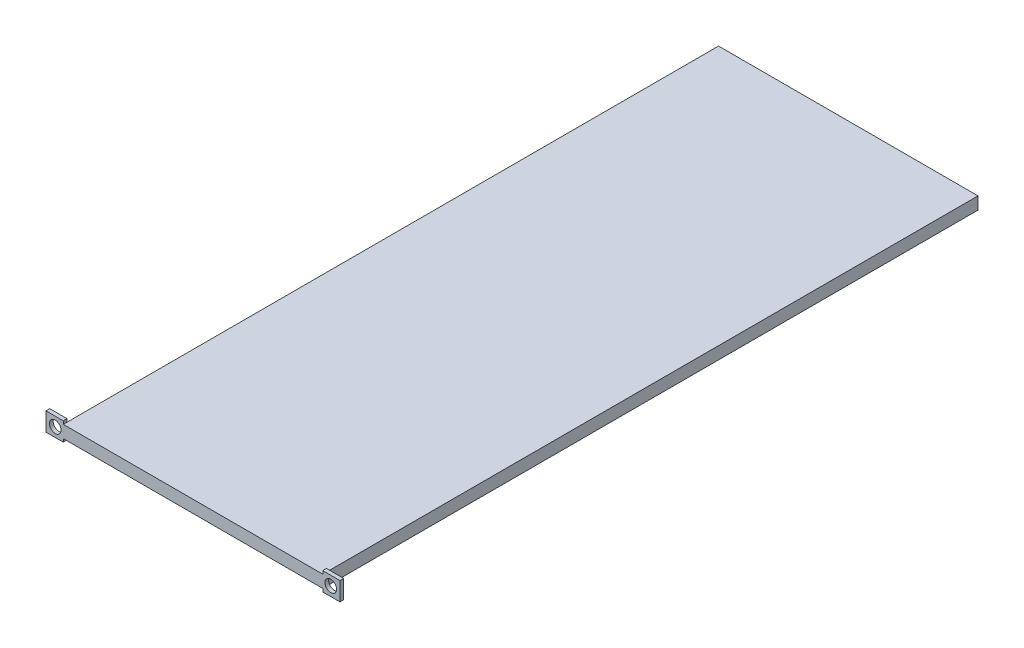
ISO-10303-21;
HEADER;
FILE_DESCRIPTION(('STEP AP214'),'2;1');
FILE_NAME('part.step','',(''),(''),'','','');
FILE_SCHEMA(('AUTOMOTIVE_DESIGN { 1 0 10303 214 1 1 1 1 }'));
ENDSEC;
DATA;
#1=APPLICATION_CONTEXT('core data for automotive mechanical design processes');
#2=APPLICATION_PROTOCOL_DEFINITION('international standard','automotive_design',2000,#1);
#3=PRODUCT_CONTEXT('',#1,'mechanical');
#4=PRODUCT('Part','Part','',(#3));
#5=PRODUCT_RELATED_PRODUCT_CATEGORY('part','',(#4));
#6=PRODUCT_DEFINITION_FORMATION('','',#4);
#7=PRODUCT_DEFINITION_CONTEXT('part definition',#1,'design');
#8=PRODUCT_DEFINITION('design','',#6,#7);
#9=PRODUCT_DEFINITION_SHAPE('','',#8);
#10=(LENGTH_UNIT() NAMED_UNIT(*) SI_UNIT(.MILLI.,.METRE.));
#11=(NAMED_UNIT(*) PLANE_ANGLE_UNIT() SI_UNIT($,.RADIAN.));
#12=(NAMED_UNIT(*) SI_UNIT($,.STERADIAN.) SOLID_ANGLE_UNIT());
#13=UNCERTAINTY_MEASURE_WITH_UNIT(LENGTH_MEASURE(1.E-05),#10,'distance_accuracy_value','');
#14=(GEOMETRIC_REPRESENTATION_CONTEXT(3) GLOBAL_UNCERTAINTY_ASSIGNED_CONTEXT((#13)) GLOBAL_UNIT_ASSIGNED_CONTEXT((#10,
#11,#12)) REPRESENTATION_CONTEXT('',''));
#15=CARTESIAN_POINT('',(0.,0.,0.));
#16=DIRECTION('',(0.,0.,1.));
#17=DIRECTION('',(1.,0.,0.));
#18=AXIS2_PLACEMENT_3D('',#15,#16,#17);
#19=CARTESIAN_POINT('',(210.28,0.,531.));
#20=DIRECTION('',(-1.,0.,0.));
#21=DIRECTION('',(0.,0.,1.));
#22=AXIS2_PLACEMENT_3D('',#19,#20,#21);
#23=PLANE('',#22);
#24=DIRECTION('',(0.,1.,0.));
#25=VECTOR('',#24,1.);
#26=CARTESIAN_POINT('',(210.28,12.5,528.));
#27=LINE('',#26,#25);
#28=CARTESIAN_POINT('',(210.28,0.,528.));
#29=VERTEX_POINT('',#28);
#30=CARTESIAN_POINT('',(210.28,10.,528.));
#31=VERTEX_POINT('',#30);
#32=EDGE_CURVE('E11',#29,#31,#27,.T.);
#33=ORIENTED_EDGE('',*,*,#32,.F.);
#34=DIRECTION('',(0.,0.,-1.));
#35=VECTOR('',#34,1.);
#36=CARTESIAN_POINT('',(210.28,0.,531.));
#37=LINE('',#36,#35);
#38=CARTESIAN_POINT('',(210.28,0.,0.));
#39=VERTEX_POINT('',#38);
#40=EDGE_CURVE('E228',#29,#39,#37,.T.);
#41=ORIENTED_EDGE('',*,*,#40,.T.);
#42=DIRECTION('',(0.,1.,0.));
#43=VECTOR('',#42,1.);
#44=CARTESIAN_POINT('',(210.28,0.,0.));
#45=LINE('',#44,#43);
#46=CARTESIAN_POINT('',(210.28,10.,0.));
#47=VERTEX_POINT('',#46);
#48=EDGE_CURVE('E218',#39,#47,#45,.T.);
#49=ORIENTED_EDGE('',*,*,#48,.T.);
#50=DIRECTION('',(0.,0.,-1.));
#51=VECTOR('',#50,1.);
#52=CARTESIAN_POINT('',(210.28,10.,531.));
#53=LINE('',#52,#51);
#54=EDGE_CURVE('E226',#31,#47,#53,.T.);
#55=ORIENTED_EDGE('',*,*,#54,.F.);
#56=EDGE_LOOP('',(#33,#41,#49,#55));
#57=FACE_BOUND('',#56,.T.);
#58=ADVANCED_FACE('F39',(#57),#23,.F.);
#59=CARTESIAN_POINT('',(0.,0.,531.));
#60=DIRECTION('',(1.,0.,0.));
#61=DIRECTION('',(0.,0.,-1.));
#62=AXIS2_PLACEMENT_3D('',#59,#60,#61);
#63=PLANE('',#62);
#64=DIRECTION('',(0.,-1.,0.));
#65=VECTOR('',#64,1.);
#66=CARTESIAN_POINT('',(0.,12.5,528.));
#67=LINE('',#66,#65);
#68=CARTESIAN_POINT('',(0.,10.,528.));
#69=VERTEX_POINT('',#68);
#70=CARTESIAN_POINT('',(0.,0.,528.));
#71=VERTEX_POINT('',#70);
#72=EDGE_CURVE('E48',#69,#71,#67,.T.);
#73=ORIENTED_EDGE('',*,*,#72,.F.);
#74=DIRECTION('',(0.,0.,-1.));
#75=VECTOR('',#74,1.);
#76=CARTESIAN_POINT('',(0.,10.,531.));
#77=LINE('',#76,#75);
#78=CARTESIAN_POINT('',(0.,10.,0.));
#79=VERTEX_POINT('',#78);
#80=EDGE_CURVE('E212',#69,#79,#77,.T.);
#81=ORIENTED_EDGE('',*,*,#80,.T.);
#82=DIRECTION('',(0.,-1.,0.));
#83=VECTOR('',#82,1.);
#84=CARTESIAN_POINT('',(0.,0.,0.));
#85=LINE('',#84,#83);
#86=CARTESIAN_POINT('',(0.,0.,0.));
#87=VERTEX_POINT('',#86);
#88=EDGE_CURVE('E206',#79,#87,#85,.T.);
#89=ORIENTED_EDGE('',*,*,#88,.T.);
#90=DIRECTION('',(0.,0.,-1.));
#91=VECTOR('',#90,1.);
#92=CARTESIAN_POINT('',(0.,0.,531.));
#93=LINE('',#92,#91);
#94=EDGE_CURVE('E231',#71,#87,#93,.T.);
#95=ORIENTED_EDGE('',*,*,#94,.F.);
#96=EDGE_LOOP('',(#73,#81,#89,#95));
#97=FACE_BOUND('',#96,.T.);
#98=ADVANCED_FACE('F41',(#97),#63,.F.);
#99=CARTESIAN_POINT('',(0.,0.,531.));
#100=DIRECTION('',(0.,1.,0.));
#101=DIRECTION('',(0.,0.,1.));
#102=AXIS2_PLACEMENT_3D('',#99,#100,#101);
#103=PLANE('',#102);
#104=DIRECTION('',(1.,0.,0.));
#105=VECTOR('',#104,1.);
#106=CARTESIAN_POINT('',(0.,0.,0.));
#107=LINE('',#106,#105);
#108=EDGE_CURVE('E215',#87,#39,#107,.T.);
#109=ORIENTED_EDGE('',*,*,#108,.T.);
#110=ORIENTED_EDGE('',*,*,#40,.F.);
#111=CARTESIAN_POINT('',(210.28,0.,531.));
#112=VERTEX_POINT('',#111);
#113=EDGE_CURVE('E229',#112,#29,#37,.T.);
#114=ORIENTED_EDGE('',*,*,#113,.F.);
#115=DIRECTION('',(1.,0.,0.));
#116=VECTOR('',#115,1.);
#117=CARTESIAN_POINT('',(0.,0.,531.));
#118=LINE('',#117,#116);
#119=CARTESIAN_POINT('',(0.,0.,531.));
#120=VERTEX_POINT('',#119);
#121=EDGE_CURVE('E207',#120,#112,#118,.T.);
#122=ORIENTED_EDGE('',*,*,#121,.F.);
#123=EDGE_CURVE('E43',#120,#71,#93,.T.);
#124=ORIENTED_EDGE('',*,*,#123,.T.);
#125=ORIENTED_EDGE('',*,*,#94,.T.);
#126=EDGE_LOOP('',(#109,#110,#114,#122,#124,#125));
#127=FACE_BOUND('',#126,.T.);
#128=ADVANCED_FACE('F240',(#127),#103,.F.);
#129=CARTESIAN_POINT('',(0.,10.,531.));
#130=DIRECTION('',(0.,-1.,0.));
#131=DIRECTION('',(0.,0.,-1.));
#132=AXIS2_PLACEMENT_3D('',#129,#130,#131);
#133=PLANE('',#132);
#134=DIRECTION('',(-1.,0.,0.));
#135=VECTOR('',#134,1.);
#136=CARTESIAN_POINT('',(0.,10.,0.));
#137=LINE('',#136,#135);
#138=EDGE_CURVE('E210',#47,#79,#137,.T.);
#139=ORIENTED_EDGE('',*,*,#138,.T.);
#140=ORIENTED_EDGE('',*,*,#80,.F.);
#141=CARTESIAN_POINT('',(0.,10.,531.));
#142=VERTEX_POINT('',#141);
#143=EDGE_CURVE('E223',#142,#69,#77,.T.);
#144=ORIENTED_EDGE('',*,*,#143,.F.);
#145=DIRECTION('',(-1.,0.,0.));
#146=VECTOR('',#145,1.);
#147=CARTESIAN_POINT('',(0.,10.,531.));
#148=LINE('',#147,#146);
#149=CARTESIAN_POINT('',(210.28,10.,531.));
#150=VERTEX_POINT('',#149);
#151=EDGE_CURVE('E209',#150,#142,#148,.T.);
#152=ORIENTED_EDGE('',*,*,#151,.F.);
#153=EDGE_CURVE('E227',#150,#31,#53,.T.);
#154=ORIENTED_EDGE('',*,*,#153,.T.);
#155=ORIENTED_EDGE('',*,*,#54,.T.);
#156=EDGE_LOOP('',(#139,#140,#144,#152,#154,#155));
#157=FACE_BOUND('',#156,.T.);
#158=ADVANCED_FACE('F245',(#157),#133,.F.);
#159=CARTESIAN_POINT('',(0.,0.,531.));
#160=DIRECTION('',(0.,0.,-1.));
#161=DIRECTION('',(-1.,0.,0.));
#162=AXIS2_PLACEMENT_3D('',#159,#160,#161);
#163=PLANE('',#162);
#164=CARTESIAN_POINT('',(-6.5,5.,531.));
#165=DIRECTION('',(0.,0.,-1.));
#166=DIRECTION('',(-1.,0.,0.));
#167=AXIS2_PLACEMENT_3D('',#164,#165,#166);
#168=CIRCLE('',#167,4.7);
#169=CARTESIAN_POINT('',(-11.2,5.,531.));
#170=VERTEX_POINT('',#169);
#171=EDGE_CURVE('E269',#170,#170,#168,.T.);
#172=ORIENTED_EDGE('',*,*,#171,.T.);
#173=EDGE_LOOP('',(#172));
#174=FACE_BOUND('',#173,.T.);
#175=CARTESIAN_POINT('',(216.78,5.,531.));
#176=DIRECTION('',(0.,0.,-1.));
#177=DIRECTION('',(-1.,0.,0.));
#178=AXIS2_PLACEMENT_3D('',#175,#176,#177);
#179=CIRCLE('',#178,4.69999999999998);
#180=CARTESIAN_POINT('',(212.08,5.,531.));
#181=VERTEX_POINT('',#180);
#182=EDGE_CURVE('E271',#181,#181,#179,.T.);
#183=ORIENTED_EDGE('',*,*,#182,.T.);
#184=EDGE_LOOP('',(#183));
#185=FACE_BOUND('',#184,.T.);
#186=ORIENTED_EDGE('',*,*,#151,.T.);
#187=DIRECTION('',(0.,1.,0.));
#188=VECTOR('',#187,1.);
#189=CARTESIAN_POINT('',(0.,12.5,531.));
#190=LINE('',#189,#188);
#191=CARTESIAN_POINT('',(0.,12.5,531.));
#192=VERTEX_POINT('',#191);
#193=EDGE_CURVE('E168',#142,#192,#190,.T.);
#194=ORIENTED_EDGE('',*,*,#193,.T.);
#195=DIRECTION('',(1.,0.,0.));
#196=VECTOR('',#195,1.);
#197=CARTESIAN_POINT('',(-14.,12.5,531.));
#198=LINE('',#197,#196);
#199=CARTESIAN_POINT('',(-14.,12.5,531.));
#200=VERTEX_POINT('',#199);
#201=EDGE_CURVE('E203',#200,#192,#198,.T.);
#202=ORIENTED_EDGE('',*,*,#201,.F.);
#203=DIRECTION('',(0.,1.,0.));
#204=VECTOR('',#203,1.);
#205=CARTESIAN_POINT('',(-14.,12.5,531.));
#206=LINE('',#205,#204);
#207=CARTESIAN_POINT('',(-14.,-2.5,531.));
#208=VERTEX_POINT('',#207);
#209=EDGE_CURVE('E176',#208,#200,#206,.T.);
#210=ORIENTED_EDGE('',*,*,#209,.F.);
#211=DIRECTION('',(1.,0.,0.));
#212=VECTOR('',#211,1.);
#213=CARTESIAN_POINT('',(-14.,-2.5,531.));
#214=LINE('',#213,#212);
#215=CARTESIAN_POINT('',(0.,-2.5,531.));
#216=VERTEX_POINT('',#215);
#217=EDGE_CURVE('E185',#208,#216,#214,.T.);
#218=ORIENTED_EDGE('',*,*,#217,.T.);
#219=EDGE_CURVE('E170',#216,#120,#190,.T.);
#220=ORIENTED_EDGE('',*,*,#219,.T.);
#221=ORIENTED_EDGE('',*,*,#121,.T.);
#222=DIRECTION('',(0.,-1.,0.));
#223=VECTOR('',#222,1.);
#224=CARTESIAN_POINT('',(210.28,12.5,531.));
#225=LINE('',#224,#223);
#226=CARTESIAN_POINT('',(210.28,-2.5,531.));
#227=VERTEX_POINT('',#226);
#228=EDGE_CURVE('E166',#112,#227,#225,.T.);
#229=ORIENTED_EDGE('',*,*,#228,.T.);
#230=DIRECTION('',(-1.,0.,0.));
#231=VECTOR('',#230,1.);
#232=CARTESIAN_POINT('',(224.28,-2.5,531.));
#233=LINE('',#232,#231);
#234=CARTESIAN_POINT('',(224.28,-2.5,531.));
#235=VERTEX_POINT('',#234);
#236=EDGE_CURVE('E147',#235,#227,#233,.T.);
#237=ORIENTED_EDGE('',*,*,#236,.F.);
#238=DIRECTION('',(0.,-1.,0.));
#239=VECTOR('',#238,1.);
#240=CARTESIAN_POINT('',(224.28,12.5,531.));
#241=LINE('',#240,#239);
#242=CARTESIAN_POINT('',(224.28,12.5,531.));
#243=VERTEX_POINT('',#242);
#244=EDGE_CURVE('E153',#243,#235,#241,.T.);
#245=ORIENTED_EDGE('',*,*,#244,.F.);
#246=DIRECTION('',(-1.,0.,0.));
#247=VECTOR('',#246,1.);
#248=CARTESIAN_POINT('',(224.28,12.5,531.));
#249=LINE('',#248,#247);
#250=CARTESIAN_POINT('',(210.28,12.5,531.));
#251=VERTEX_POINT('',#250);
#252=EDGE_CURVE('E263',#243,#251,#249,.T.);
#253=ORIENTED_EDGE('',*,*,#252,.T.);
#254=EDGE_CURVE('E268',#251,#150,#225,.T.);
#255=ORIENTED_EDGE('',*,*,#254,.T.);
#256=EDGE_LOOP('',(#186,#194,#202,#210,#218,#220,#221,#229,#237,#245,#253,#255));
#257=FACE_BOUND('',#256,.T.);
#258=ADVANCED_FACE('F164',(#174,#185,#257),#163,.F.);
#259=CARTESIAN_POINT('',(0.,0.,0.));
#260=DIRECTION('',(0.,0.,-1.));
#261=DIRECTION('',(-1.,0.,0.));
#262=AXIS2_PLACEMENT_3D('',#259,#260,#261);
#263=PLANE('',#262);
#264=ORIENTED_EDGE('',*,*,#88,.F.);
#265=ORIENTED_EDGE('',*,*,#138,.F.);
#266=ORIENTED_EDGE('',*,*,#48,.F.);
#267=ORIENTED_EDGE('',*,*,#108,.F.);
#268=EDGE_LOOP('',(#264,#265,#266,#267));
#269=FACE_BOUND('',#268,.T.);
#270=ADVANCED_FACE('F243',(#269),#263,.T.);
#271=CARTESIAN_POINT('',(0.,0.,0.));
#272=DIRECTION('',(1.,0.,0.));
#273=DIRECTION('',(0.,0.,-1.));
#274=AXIS2_PLACEMENT_3D('',#271,#272,#273);
#275=PLANE('',#274);
#276=ORIENTED_EDGE('',*,*,#123,.F.);
#277=ORIENTED_EDGE('',*,*,#219,.F.);
#278=DIRECTION('',(0.,0.,1.));
#279=VECTOR('',#278,1.);
#280=CARTESIAN_POINT('',(0.,-2.5,531.));
#281=LINE('',#280,#279);
#282=CARTESIAN_POINT('',(0.,-2.5,528.));
#283=VERTEX_POINT('',#282);
#284=EDGE_CURVE('E180',#283,#216,#281,.T.);
#285=ORIENTED_EDGE('',*,*,#284,.F.);
#286=EDGE_CURVE('E190',#71,#283,#67,.T.);
#287=ORIENTED_EDGE('',*,*,#286,.F.);
#288=EDGE_LOOP('',(#276,#277,#285,#287));
#289=FACE_BOUND('',#288,.T.);
#290=ADVANCED_FACE('F314',(#289),#275,.T.);
#291=CARTESIAN_POINT('',(-14.,12.5,531.));
#292=DIRECTION('',(0.,-1.,0.));
#293=DIRECTION('',(0.,0.,-1.));
#294=AXIS2_PLACEMENT_3D('',#291,#292,#293);
#295=PLANE('',#294);
#296=DIRECTION('',(0.,0.,-1.));
#297=VECTOR('',#296,1.);
#298=CARTESIAN_POINT('',(0.,12.5,531.));
#299=LINE('',#298,#297);
#300=CARTESIAN_POINT('',(0.,12.5,528.));
#301=VERTEX_POINT('',#300);
#302=EDGE_CURVE('E188',#192,#301,#299,.T.);
#303=ORIENTED_EDGE('',*,*,#302,.T.);
#304=DIRECTION('',(1.,0.,0.));
#305=VECTOR('',#304,1.);
#306=CARTESIAN_POINT('',(-14.,12.5,528.));
#307=LINE('',#306,#305);
#308=CARTESIAN_POINT('',(-14.,12.5,528.));
#309=VERTEX_POINT('',#308);
#310=EDGE_CURVE('E200',#309,#301,#307,.T.);
#311=ORIENTED_EDGE('',*,*,#310,.F.);
#312=DIRECTION('',(0.,0.,-1.));
#313=VECTOR('',#312,1.);
#314=CARTESIAN_POINT('',(-14.,12.5,531.));
#315=LINE('',#314,#313);
#316=EDGE_CURVE('E179',#200,#309,#315,.T.);
#317=ORIENTED_EDGE('',*,*,#316,.F.);
#318=ORIENTED_EDGE('',*,*,#201,.T.);
#319=EDGE_LOOP('',(#303,#311,#317,#318));
#320=FACE_BOUND('',#319,.T.);
#321=ADVANCED_FACE('F292',(#320),#295,.F.);
#322=CARTESIAN_POINT('',(-14.,12.5,528.));
#323=DIRECTION('',(0.,0.,1.));
#324=DIRECTION('',(1.,0.,0.));
#325=AXIS2_PLACEMENT_3D('',#322,#323,#324);
#326=PLANE('',#325);
#327=CARTESIAN_POINT('',(-6.5,5.,528.));
#328=DIRECTION('',(0.,0.,-1.));
#329=DIRECTION('',(-1.,0.,0.));
#330=AXIS2_PLACEMENT_3D('',#327,#328,#329);
#331=CIRCLE('',#330,4.7);
#332=CARTESIAN_POINT('',(-11.2,5.,528.));
#333=VERTEX_POINT('',#332);
#334=EDGE_CURVE('E276',#333,#333,#331,.T.);
#335=ORIENTED_EDGE('',*,*,#334,.F.);
#336=EDGE_LOOP('',(#335));
#337=FACE_BOUND('',#336,.T.);
#338=EDGE_CURVE('E191',#301,#69,#67,.T.);
#339=ORIENTED_EDGE('',*,*,#338,.T.);
#340=ORIENTED_EDGE('',*,*,#72,.T.);
#341=ORIENTED_EDGE('',*,*,#286,.T.);
#342=DIRECTION('',(1.,0.,0.));
#343=VECTOR('',#342,1.);
#344=CARTESIAN_POINT('',(-14.,-2.5,528.));
#345=LINE('',#344,#343);
#346=CARTESIAN_POINT('',(-14.,-2.5,528.));
#347=VERTEX_POINT('',#346);
#348=EDGE_CURVE('E197',#347,#283,#345,.T.);
#349=ORIENTED_EDGE('',*,*,#348,.F.);
#350=DIRECTION('',(0.,-1.,0.));
#351=VECTOR('',#350,1.);
#352=CARTESIAN_POINT('',(-14.,12.5,528.));
#353=LINE('',#352,#351);
#354=EDGE_CURVE('E182',#309,#347,#353,.T.);
#355=ORIENTED_EDGE('',*,*,#354,.F.);
#356=ORIENTED_EDGE('',*,*,#310,.T.);
#357=EDGE_LOOP('',(#339,#340,#341,#349,#355,#356));
#358=FACE_BOUND('',#357,.T.);
#359=ADVANCED_FACE('F288',(#337,#358),#326,.F.);
#360=CARTESIAN_POINT('',(-14.,-2.5,531.));
#361=DIRECTION('',(0.,1.,0.));
#362=DIRECTION('',(0.,0.,1.));
#363=AXIS2_PLACEMENT_3D('',#360,#361,#362);
#364=PLANE('',#363);
#365=ORIENTED_EDGE('',*,*,#284,.T.);
#366=ORIENTED_EDGE('',*,*,#217,.F.);
#367=DIRECTION('',(0.,0.,1.));
#368=VECTOR('',#367,1.);
#369=CARTESIAN_POINT('',(-14.,-2.5,531.));
#370=LINE('',#369,#368);
#371=EDGE_CURVE('E184',#347,#208,#370,.T.);
#372=ORIENTED_EDGE('',*,*,#371,.F.);
#373=ORIENTED_EDGE('',*,*,#348,.T.);
#374=EDGE_LOOP('',(#365,#366,#372,#373));
#375=FACE_BOUND('',#374,.T.);
#376=ADVANCED_FACE('F291',(#375),#364,.F.);
#377=CARTESIAN_POINT('',(-14.,0.,0.));
#378=DIRECTION('',(1.,0.,0.));
#379=DIRECTION('',(0.,0.,-1.));
#380=AXIS2_PLACEMENT_3D('',#377,#378,#379);
#381=PLANE('',#380);
#382=ORIENTED_EDGE('',*,*,#209,.T.);
#383=ORIENTED_EDGE('',*,*,#316,.T.);
#384=ORIENTED_EDGE('',*,*,#354,.T.);
#385=ORIENTED_EDGE('',*,*,#371,.T.);
#386=EDGE_LOOP('',(#382,#383,#384,#385));
#387=FACE_BOUND('',#386,.T.);
#388=ADVANCED_FACE('F305',(#387),#381,.F.);
#389=ORIENTED_EDGE('',*,*,#193,.F.);
#390=ORIENTED_EDGE('',*,*,#143,.T.);
#391=ORIENTED_EDGE('',*,*,#338,.F.);
#392=ORIENTED_EDGE('',*,*,#302,.F.);
#393=EDGE_LOOP('',(#389,#390,#391,#392));
#394=FACE_BOUND('',#393,.T.);
#395=ADVANCED_FACE('F300',(#394),#275,.T.);
#396=CARTESIAN_POINT('',(210.28,0.,0.));
#397=DIRECTION('',(1.,0.,0.));
#398=DIRECTION('',(0.,0.,-1.));
#399=AXIS2_PLACEMENT_3D('',#396,#397,#398);
#400=PLANE('',#399);
#401=ORIENTED_EDGE('',*,*,#228,.F.);
#402=ORIENTED_EDGE('',*,*,#113,.T.);
#403=CARTESIAN_POINT('',(210.28,-2.5,528.));
#404=VERTEX_POINT('',#403);
#405=EDGE_CURVE('E50',#404,#29,#27,.T.);
#406=ORIENTED_EDGE('',*,*,#405,.F.);
#407=DIRECTION('',(0.,0.,-1.));
#408=VECTOR('',#407,1.);
#409=CARTESIAN_POINT('',(210.28,-2.5,531.));
#410=LINE('',#409,#408);
#411=EDGE_CURVE('E257',#227,#404,#410,.T.);
#412=ORIENTED_EDGE('',*,*,#411,.F.);
#413=EDGE_LOOP('',(#401,#402,#406,#412));
#414=FACE_BOUND('',#413,.T.);
#415=ADVANCED_FACE('F337',(#414),#400,.F.);
#416=CARTESIAN_POINT('',(224.28,-2.5,531.));
#417=DIRECTION('',(0.,1.,0.));
#418=DIRECTION('',(0.,0.,1.));
#419=AXIS2_PLACEMENT_3D('',#416,#417,#418);
#420=PLANE('',#419);
#421=ORIENTED_EDGE('',*,*,#411,.T.);
#422=DIRECTION('',(-1.,0.,0.));
#423=VECTOR('',#422,1.);
#424=CARTESIAN_POINT('',(224.28,-2.5,528.));
#425=LINE('',#424,#423);
#426=CARTESIAN_POINT('',(224.28,-2.5,528.));
#427=VERTEX_POINT('',#426);
#428=EDGE_CURVE('E149',#427,#404,#425,.T.);
#429=ORIENTED_EDGE('',*,*,#428,.F.);
#430=DIRECTION('',(0.,0.,-1.));
#431=VECTOR('',#430,1.);
#432=CARTESIAN_POINT('',(224.28,-2.5,531.));
#433=LINE('',#432,#431);
#434=EDGE_CURVE('E143',#235,#427,#433,.T.);
#435=ORIENTED_EDGE('',*,*,#434,.F.);
#436=ORIENTED_EDGE('',*,*,#236,.T.);
#437=EDGE_LOOP('',(#421,#429,#435,#436));
#438=FACE_BOUND('',#437,.T.);
#439=ADVANCED_FACE('F145',(#438),#420,.F.);
#440=CARTESIAN_POINT('',(224.28,12.5,528.));
#441=DIRECTION('',(0.,0.,1.));
#442=DIRECTION('',(1.,0.,0.));
#443=AXIS2_PLACEMENT_3D('',#440,#441,#442);
#444=PLANE('',#443);
#445=CARTESIAN_POINT('',(216.78,5.,528.));
#446=DIRECTION('',(0.,0.,-1.));
#447=DIRECTION('',(1.,0.,0.));
#448=AXIS2_PLACEMENT_3D('',#445,#446,#447);
#449=CIRCLE('',#448,4.69999999999998);
#450=CARTESIAN_POINT('',(221.48,5.,528.));
#451=VERTEX_POINT('',#450);
#452=EDGE_CURVE('E279',#451,#451,#449,.T.);
#453=ORIENTED_EDGE('',*,*,#452,.F.);
#454=EDGE_LOOP('',(#453));
#455=FACE_BOUND('',#454,.T.);
#456=ORIENTED_EDGE('',*,*,#405,.T.);
#457=ORIENTED_EDGE('',*,*,#32,.T.);
#458=CARTESIAN_POINT('',(210.28,12.5,528.));
#459=VERTEX_POINT('',#458);
#460=EDGE_CURVE('E51',#31,#459,#27,.T.);
#461=ORIENTED_EDGE('',*,*,#460,.T.);
#462=DIRECTION('',(-1.,0.,0.));
#463=VECTOR('',#462,1.);
#464=CARTESIAN_POINT('',(224.28,12.5,528.));
#465=LINE('',#464,#463);
#466=CARTESIAN_POINT('',(224.28,12.5,528.));
#467=VERTEX_POINT('',#466);
#468=EDGE_CURVE('E172',#467,#459,#465,.T.);
#469=ORIENTED_EDGE('',*,*,#468,.F.);
#470=DIRECTION('',(0.,1.,0.));
#471=VECTOR('',#470,1.);
#472=CARTESIAN_POINT('',(224.28,12.5,528.));
#473=LINE('',#472,#471);
#474=EDGE_CURVE('E152',#427,#467,#473,.T.);
#475=ORIENTED_EDGE('',*,*,#474,.F.);
#476=ORIENTED_EDGE('',*,*,#428,.T.);
#477=EDGE_LOOP('',(#456,#457,#461,#469,#475,#476));
#478=FACE_BOUND('',#477,.T.);
#479=ADVANCED_FACE('F258',(#455,#478),#444,.F.);
#480=CARTESIAN_POINT('',(224.28,12.5,531.));
#481=DIRECTION('',(0.,-1.,0.));
#482=DIRECTION('',(0.,0.,-1.));
#483=AXIS2_PLACEMENT_3D('',#480,#481,#482);
#484=PLANE('',#483);
#485=DIRECTION('',(0.,0.,1.));
#486=VECTOR('',#485,1.);
#487=CARTESIAN_POINT('',(210.28,12.5,531.));
#488=LINE('',#487,#486);
#489=EDGE_CURVE('E162',#459,#251,#488,.T.);
#490=ORIENTED_EDGE('',*,*,#489,.T.);
#491=ORIENTED_EDGE('',*,*,#252,.F.);
#492=DIRECTION('',(0.,0.,1.));
#493=VECTOR('',#492,1.);
#494=CARTESIAN_POINT('',(224.28,12.5,531.));
#495=LINE('',#494,#493);
#496=EDGE_CURVE('E158',#467,#243,#495,.T.);
#497=ORIENTED_EDGE('',*,*,#496,.F.);
#498=ORIENTED_EDGE('',*,*,#468,.T.);
#499=EDGE_LOOP('',(#490,#491,#497,#498));
#500=FACE_BOUND('',#499,.T.);
#501=ADVANCED_FACE('F265',(#500),#484,.F.);
#502=CARTESIAN_POINT('',(224.28,0.,0.));
#503=DIRECTION('',(1.,0.,0.));
#504=DIRECTION('',(0.,0.,-1.));
#505=AXIS2_PLACEMENT_3D('',#502,#503,#504);
#506=PLANE('',#505);
#507=ORIENTED_EDGE('',*,*,#244,.T.);
#508=ORIENTED_EDGE('',*,*,#434,.T.);
#509=ORIENTED_EDGE('',*,*,#474,.T.);
#510=ORIENTED_EDGE('',*,*,#496,.T.);
#511=EDGE_LOOP('',(#507,#508,#509,#510));
#512=FACE_BOUND('',#511,.T.);
#513=ADVANCED_FACE('F156',(#512),#506,.T.);
#514=ORIENTED_EDGE('',*,*,#153,.F.);
#515=ORIENTED_EDGE('',*,*,#254,.F.);
#516=ORIENTED_EDGE('',*,*,#489,.F.);
#517=ORIENTED_EDGE('',*,*,#460,.F.);
#518=EDGE_LOOP('',(#514,#515,#516,#517));
#519=FACE_BOUND('',#518,.T.);
#520=ADVANCED_FACE('F251',(#519),#400,.F.);
#521=CARTESIAN_POINT('',(216.78,5.,541.));
#522=DIRECTION('',(0.,0.,-1.));
#523=DIRECTION('',(-1.,0.,0.));
#524=AXIS2_PLACEMENT_3D('',#521,#522,#523);
#525=CYLINDRICAL_SURFACE('',#524,4.69999999999998);
#526=ORIENTED_EDGE('',*,*,#452,.T.);
#527=EDGE_LOOP('',(#526));
#528=FACE_BOUND('',#527,.T.);
#529=ORIENTED_EDGE('',*,*,#182,.F.);
#530=EDGE_LOOP('',(#529));
#531=FACE_BOUND('',#530,.T.);
#532=ADVANCED_FACE('F349',(#528,#531),#525,.F.);
#533=CARTESIAN_POINT('',(-6.5,5.,541.));
#534=DIRECTION('',(0.,0.,-1.));
#535=DIRECTION('',(-1.,0.,0.));
#536=AXIS2_PLACEMENT_3D('',#533,#534,#535);
#537=CYLINDRICAL_SURFACE('',#536,4.7);
#538=ORIENTED_EDGE('',*,*,#334,.T.);
#539=EDGE_LOOP('',(#538));
#540=FACE_BOUND('',#539,.T.);
#541=ORIENTED_EDGE('',*,*,#171,.F.);
#542=EDGE_LOOP('',(#541));
#543=FACE_BOUND('',#542,.T.);
#544=ADVANCED_FACE('F285',(#540,#543),#537,.F.);
#545=CLOSED_SHELL('',(#58,#98,#128,#158,#258,#270,#290,#321,#359,#376,#388,#395,#415,#439,#479,
#501,#513,#520,#532,#544));
#546=MANIFOLD_SOLID_BREP('B2',#545);
#547=ADVANCED_BREP_SHAPE_REPRESENTATION('',(#18,#546),#14);
#548=SHAPE_DEFINITION_REPRESENTATION(#9,#547);
ENDSEC;
END-ISO-10303-21;
